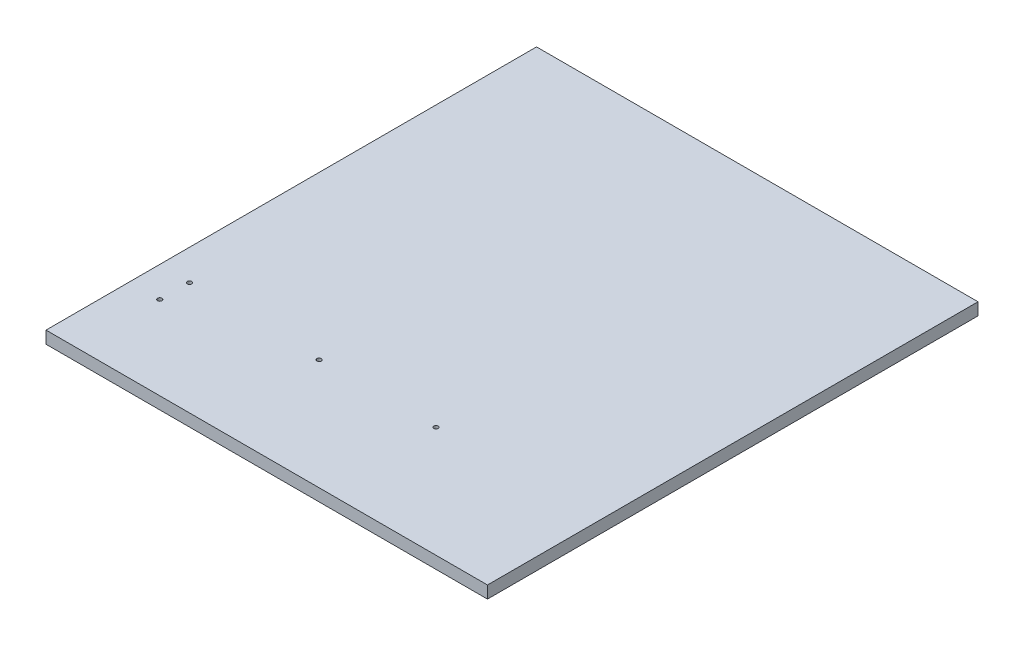
ISO-10303-21;
HEADER;
FILE_DESCRIPTION(('STEP AP214'),'2;1');
FILE_NAME('part.step','',(''),(''),'','','');
FILE_SCHEMA(('AUTOMOTIVE_DESIGN { 1 0 10303 214 1 1 1 1 }'));
ENDSEC;
DATA;
#1=APPLICATION_CONTEXT('core data for automotive mechanical design processes');
#2=APPLICATION_PROTOCOL_DEFINITION('international standard','automotive_design',2000,#1);
#3=PRODUCT_CONTEXT('',#1,'mechanical');
#4=PRODUCT('Part','Part','',(#3));
#5=PRODUCT_RELATED_PRODUCT_CATEGORY('part','',(#4));
#6=PRODUCT_DEFINITION_FORMATION('','',#4);
#7=PRODUCT_DEFINITION_CONTEXT('part definition',#1,'design');
#8=PRODUCT_DEFINITION('design','',#6,#7);
#9=PRODUCT_DEFINITION_SHAPE('','',#8);
#10=(LENGTH_UNIT() NAMED_UNIT(*) SI_UNIT(.MILLI.,.METRE.));
#11=(NAMED_UNIT(*) PLANE_ANGLE_UNIT() SI_UNIT($,.RADIAN.));
#12=(NAMED_UNIT(*) SI_UNIT($,.STERADIAN.) SOLID_ANGLE_UNIT());
#13=UNCERTAINTY_MEASURE_WITH_UNIT(LENGTH_MEASURE(1.E-05),#10,'distance_accuracy_value','');
#14=(GEOMETRIC_REPRESENTATION_CONTEXT(3) GLOBAL_UNCERTAINTY_ASSIGNED_CONTEXT((#13)) GLOBAL_UNIT_ASSIGNED_CONTEXT((#10,
#11,#12)) REPRESENTATION_CONTEXT('',''));
#15=CARTESIAN_POINT('',(0.,0.,0.));
#16=DIRECTION('',(0.,0.,1.));
#17=DIRECTION('',(1.,0.,0.));
#18=AXIS2_PLACEMENT_3D('',#15,#16,#17);
#19=CARTESIAN_POINT('',(0.,6.35,0.));
#20=DIRECTION('',(1.,0.,0.));
#21=DIRECTION('',(0.,0.,-1.));
#22=AXIS2_PLACEMENT_3D('',#19,#20,#21);
#23=PLANE('',#22);
#24=DIRECTION('',(0.,0.,1.));
#25=VECTOR('',#24,1.);
#26=CARTESIAN_POINT('',(0.,0.,0.));
#27=LINE('',#26,#25);
#28=CARTESIAN_POINT('',(0.,0.,-254.));
#29=VERTEX_POINT('',#28);
#30=CARTESIAN_POINT('',(0.,0.,0.));
#31=VERTEX_POINT('',#30);
#32=EDGE_CURVE('E110',#29,#31,#27,.T.);
#33=ORIENTED_EDGE('',*,*,#32,.T.);
#34=DIRECTION('',(0.,-1.,0.));
#35=VECTOR('',#34,1.);
#36=CARTESIAN_POINT('',(0.,6.35,0.));
#37=LINE('',#36,#35);
#38=CARTESIAN_POINT('',(0.,6.35,0.));
#39=VERTEX_POINT('',#38);
#40=EDGE_CURVE('E11',#39,#31,#37,.T.);
#41=ORIENTED_EDGE('',*,*,#40,.F.);
#42=DIRECTION('',(0.,0.,1.));
#43=VECTOR('',#42,1.);
#44=CARTESIAN_POINT('',(0.,6.35,0.));
#45=LINE('',#44,#43);
#46=CARTESIAN_POINT('',(0.,6.35,-254.));
#47=VERTEX_POINT('',#46);
#48=EDGE_CURVE('E98',#47,#39,#45,.T.);
#49=ORIENTED_EDGE('',*,*,#48,.F.);
#50=DIRECTION('',(0.,-1.,0.));
#51=VECTOR('',#50,1.);
#52=CARTESIAN_POINT('',(0.,6.35,-254.));
#53=LINE('',#52,#51);
#54=EDGE_CURVE('E106',#47,#29,#53,.T.);
#55=ORIENTED_EDGE('',*,*,#54,.T.);
#56=EDGE_LOOP('',(#33,#41,#49,#55));
#57=FACE_BOUND('',#56,.T.);
#58=ADVANCED_FACE('F47',(#57),#23,.F.);
#59=CARTESIAN_POINT('',(0.,6.35,0.));
#60=DIRECTION('',(0.,0.,-1.));
#61=DIRECTION('',(-1.,0.,0.));
#62=AXIS2_PLACEMENT_3D('',#59,#60,#61);
#63=PLANE('',#62);
#64=DIRECTION('',(1.,0.,0.));
#65=VECTOR('',#64,1.);
#66=CARTESIAN_POINT('',(0.,0.,0.));
#67=LINE('',#66,#65);
#68=CARTESIAN_POINT('',(228.6,0.,0.));
#69=VERTEX_POINT('',#68);
#70=EDGE_CURVE('E102',#31,#69,#67,.T.);
#71=ORIENTED_EDGE('',*,*,#70,.T.);
#72=DIRECTION('',(0.,-1.,0.));
#73=VECTOR('',#72,1.);
#74=CARTESIAN_POINT('',(228.6,6.35,0.));
#75=LINE('',#74,#73);
#76=CARTESIAN_POINT('',(228.6,6.35,0.));
#77=VERTEX_POINT('',#76);
#78=EDGE_CURVE('E55',#77,#69,#75,.T.);
#79=ORIENTED_EDGE('',*,*,#78,.F.);
#80=DIRECTION('',(1.,0.,0.));
#81=VECTOR('',#80,1.);
#82=CARTESIAN_POINT('',(0.,6.35,0.));
#83=LINE('',#82,#81);
#84=EDGE_CURVE('E93',#39,#77,#83,.T.);
#85=ORIENTED_EDGE('',*,*,#84,.F.);
#86=ORIENTED_EDGE('',*,*,#40,.T.);
#87=EDGE_LOOP('',(#71,#79,#85,#86));
#88=FACE_BOUND('',#87,.T.);
#89=ADVANCED_FACE('F101',(#88),#63,.F.);
#90=CARTESIAN_POINT('',(228.6,6.35,0.));
#91=DIRECTION('',(-1.,0.,0.));
#92=DIRECTION('',(0.,0.,1.));
#93=AXIS2_PLACEMENT_3D('',#90,#91,#92);
#94=PLANE('',#93);
#95=DIRECTION('',(0.,0.,-1.));
#96=VECTOR('',#95,1.);
#97=CARTESIAN_POINT('',(228.6,0.,0.));
#98=LINE('',#97,#96);
#99=CARTESIAN_POINT('',(228.6,0.,-254.));
#100=VERTEX_POINT('',#99);
#101=EDGE_CURVE('E80',#69,#100,#98,.T.);
#102=ORIENTED_EDGE('',*,*,#101,.T.);
#103=DIRECTION('',(0.,-1.,0.));
#104=VECTOR('',#103,1.);
#105=CARTESIAN_POINT('',(228.6,6.35,-254.));
#106=LINE('',#105,#104);
#107=CARTESIAN_POINT('',(228.6,6.35,-254.));
#108=VERTEX_POINT('',#107);
#109=EDGE_CURVE('E103',#108,#100,#106,.T.);
#110=ORIENTED_EDGE('',*,*,#109,.F.);
#111=DIRECTION('',(0.,0.,-1.));
#112=VECTOR('',#111,1.);
#113=CARTESIAN_POINT('',(228.6,6.35,0.));
#114=LINE('',#113,#112);
#115=EDGE_CURVE('E96',#77,#108,#114,.T.);
#116=ORIENTED_EDGE('',*,*,#115,.F.);
#117=ORIENTED_EDGE('',*,*,#78,.T.);
#118=EDGE_LOOP('',(#102,#110,#116,#117));
#119=FACE_BOUND('',#118,.T.);
#120=ADVANCED_FACE('F104',(#119),#94,.F.);
#121=CARTESIAN_POINT('',(0.,6.35,-254.));
#122=DIRECTION('',(0.,0.,1.));
#123=DIRECTION('',(1.,0.,0.));
#124=AXIS2_PLACEMENT_3D('',#121,#122,#123);
#125=PLANE('',#124);
#126=DIRECTION('',(-1.,0.,0.));
#127=VECTOR('',#126,1.);
#128=CARTESIAN_POINT('',(0.,0.,-254.));
#129=LINE('',#128,#127);
#130=EDGE_CURVE('E86',#100,#29,#129,.T.);
#131=ORIENTED_EDGE('',*,*,#130,.T.);
#132=ORIENTED_EDGE('',*,*,#54,.F.);
#133=DIRECTION('',(-1.,0.,0.));
#134=VECTOR('',#133,1.);
#135=CARTESIAN_POINT('',(0.,6.35,-254.));
#136=LINE('',#135,#134);
#137=EDGE_CURVE('E63',#108,#47,#136,.T.);
#138=ORIENTED_EDGE('',*,*,#137,.F.);
#139=ORIENTED_EDGE('',*,*,#109,.T.);
#140=EDGE_LOOP('',(#131,#132,#138,#139));
#141=FACE_BOUND('',#140,.T.);
#142=ADVANCED_FACE('F118',(#141),#125,.F.);
#143=CARTESIAN_POINT('',(0.,6.35,0.));
#144=DIRECTION('',(0.,-1.,0.));
#145=DIRECTION('',(0.,0.,-1.));
#146=AXIS2_PLACEMENT_3D('',#143,#144,#145);
#147=PLANE('',#146);
#148=CARTESIAN_POINT('',(15.7351594072584,6.35,-43.18));
#149=DIRECTION('',(0.,1.,0.));
#150=DIRECTION('',(0.,0.,1.));
#151=AXIS2_PLACEMENT_3D('',#148,#149,#150);
#152=CIRCLE('',#151,1.13029999999999);
#153=CARTESIAN_POINT('',(15.7351594072584,6.35,-42.0497));
#154=VERTEX_POINT('',#153);
#155=EDGE_CURVE('E144',#154,#154,#152,.T.);
#156=ORIENTED_EDGE('',*,*,#155,.F.);
#157=EDGE_LOOP('',(#156));
#158=FACE_BOUND('',#157,.T.);
#159=CARTESIAN_POINT('',(15.8749999999998,6.35,-58.42));
#160=DIRECTION('',(0.,1.,0.));
#161=DIRECTION('',(0.,0.,1.));
#162=AXIS2_PLACEMENT_3D('',#159,#160,#161);
#163=CIRCLE('',#162,1.13029999999999);
#164=CARTESIAN_POINT('',(15.8749999999998,6.35,-57.2897));
#165=VERTEX_POINT('',#164);
#166=EDGE_CURVE('E138',#165,#165,#163,.T.);
#167=ORIENTED_EDGE('',*,*,#166,.F.);
#168=EDGE_LOOP('',(#167));
#169=FACE_BOUND('',#168,.T.);
#170=CARTESIAN_POINT('',(84.0588414103042,6.35,-57.3884371810008));
#171=DIRECTION('',(0.,1.,0.));
#172=DIRECTION('',(0.,0.,1.));
#173=AXIS2_PLACEMENT_3D('',#170,#171,#172);
#174=CIRCLE('',#173,1.13029999999999);
#175=CARTESIAN_POINT('',(84.0588414103042,6.35,-56.2581371810008));
#176=VERTEX_POINT('',#175);
#177=EDGE_CURVE('E132',#176,#176,#174,.T.);
#178=ORIENTED_EDGE('',*,*,#177,.F.);
#179=EDGE_LOOP('',(#178));
#180=FACE_BOUND('',#179,.T.);
#181=CARTESIAN_POINT('',(144.561688198213,6.35,-57.3884371810008));
#182=DIRECTION('',(0.,1.,0.));
#183=DIRECTION('',(0.,0.,1.));
#184=AXIS2_PLACEMENT_3D('',#181,#182,#183);
#185=CIRCLE('',#184,1.1303);
#186=CARTESIAN_POINT('',(144.561688198213,6.35,-56.2581371810008));
#187=VERTEX_POINT('',#186);
#188=EDGE_CURVE('E126',#187,#187,#185,.T.);
#189=ORIENTED_EDGE('',*,*,#188,.F.);
#190=EDGE_LOOP('',(#189));
#191=FACE_BOUND('',#190,.T.);
#192=ORIENTED_EDGE('',*,*,#48,.T.);
#193=ORIENTED_EDGE('',*,*,#84,.T.);
#194=ORIENTED_EDGE('',*,*,#115,.T.);
#195=ORIENTED_EDGE('',*,*,#137,.T.);
#196=EDGE_LOOP('',(#192,#193,#194,#195));
#197=FACE_BOUND('',#196,.T.);
#198=ADVANCED_FACE('F94',(#158,#169,#180,#191,#197),#147,.F.);
#199=CARTESIAN_POINT('',(0.,0.,0.));
#200=DIRECTION('',(0.,-1.,0.));
#201=DIRECTION('',(0.,0.,-1.));
#202=AXIS2_PLACEMENT_3D('',#199,#200,#201);
#203=PLANE('',#202);
#204=CARTESIAN_POINT('',(15.7351594072584,0.,-43.18));
#205=DIRECTION('',(0.,1.,0.));
#206=DIRECTION('',(0.,0.,1.));
#207=AXIS2_PLACEMENT_3D('',#204,#205,#206);
#208=CIRCLE('',#207,1.1303);
#209=CARTESIAN_POINT('',(15.7351594072584,0.,-42.0497));
#210=VERTEX_POINT('',#209);
#211=EDGE_CURVE('E141',#210,#210,#208,.T.);
#212=ORIENTED_EDGE('',*,*,#211,.T.);
#213=EDGE_LOOP('',(#212));
#214=FACE_BOUND('',#213,.T.);
#215=CARTESIAN_POINT('',(15.8749999999998,0.,-58.42));
#216=DIRECTION('',(0.,1.,0.));
#217=DIRECTION('',(0.,0.,1.));
#218=AXIS2_PLACEMENT_3D('',#215,#216,#217);
#219=CIRCLE('',#218,1.1303);
#220=CARTESIAN_POINT('',(15.8749999999998,0.,-57.2897));
#221=VERTEX_POINT('',#220);
#222=EDGE_CURVE('E135',#221,#221,#219,.T.);
#223=ORIENTED_EDGE('',*,*,#222,.T.);
#224=EDGE_LOOP('',(#223));
#225=FACE_BOUND('',#224,.T.);
#226=CARTESIAN_POINT('',(84.0588414103042,0.,-57.3884371810008));
#227=DIRECTION('',(0.,1.,0.));
#228=DIRECTION('',(0.,0.,1.));
#229=AXIS2_PLACEMENT_3D('',#226,#227,#228);
#230=CIRCLE('',#229,1.1303);
#231=CARTESIAN_POINT('',(84.0588414103042,0.,-56.2581371810008));
#232=VERTEX_POINT('',#231);
#233=EDGE_CURVE('E129',#232,#232,#230,.T.);
#234=ORIENTED_EDGE('',*,*,#233,.T.);
#235=EDGE_LOOP('',(#234));
#236=FACE_BOUND('',#235,.T.);
#237=CARTESIAN_POINT('',(144.561688198213,0.,-57.3884371810008));
#238=DIRECTION('',(0.,1.,0.));
#239=DIRECTION('',(0.,0.,1.));
#240=AXIS2_PLACEMENT_3D('',#237,#238,#239);
#241=CIRCLE('',#240,1.1303);
#242=CARTESIAN_POINT('',(144.561688198213,0.,-56.2581371810008));
#243=VERTEX_POINT('',#242);
#244=EDGE_CURVE('E113',#243,#243,#241,.T.);
#245=ORIENTED_EDGE('',*,*,#244,.T.);
#246=EDGE_LOOP('',(#245));
#247=FACE_BOUND('',#246,.T.);
#248=ORIENTED_EDGE('',*,*,#32,.F.);
#249=ORIENTED_EDGE('',*,*,#130,.F.);
#250=ORIENTED_EDGE('',*,*,#101,.F.);
#251=ORIENTED_EDGE('',*,*,#70,.F.);
#252=EDGE_LOOP('',(#248,#249,#250,#251));
#253=FACE_BOUND('',#252,.T.);
#254=ADVANCED_FACE('F121',(#214,#225,#236,#247,#253),#203,.T.);
#255=CARTESIAN_POINT('',(144.561688198213,6.35,-57.3884371810008));
#256=DIRECTION('',(0.,1.,0.));
#257=DIRECTION('',(0.,0.,1.));
#258=AXIS2_PLACEMENT_3D('',#255,#256,#257);
#259=CYLINDRICAL_SURFACE('',#258,1.1303);
#260=ORIENTED_EDGE('',*,*,#244,.F.);
#261=EDGE_LOOP('',(#260));
#262=FACE_BOUND('',#261,.T.);
#263=ORIENTED_EDGE('',*,*,#188,.T.);
#264=EDGE_LOOP('',(#263));
#265=FACE_BOUND('',#264,.T.);
#266=ADVANCED_FACE('F159',(#262,#265),#259,.F.);
#267=CARTESIAN_POINT('',(84.0588414103042,6.35,-57.3884371810008));
#268=DIRECTION('',(0.,1.,0.));
#269=DIRECTION('',(0.,0.,1.));
#270=AXIS2_PLACEMENT_3D('',#267,#268,#269);
#271=CYLINDRICAL_SURFACE('',#270,1.13029999999999);
#272=ORIENTED_EDGE('',*,*,#233,.F.);
#273=EDGE_LOOP('',(#272));
#274=FACE_BOUND('',#273,.T.);
#275=ORIENTED_EDGE('',*,*,#177,.T.);
#276=EDGE_LOOP('',(#275));
#277=FACE_BOUND('',#276,.T.);
#278=ADVANCED_FACE('F161',(#274,#277),#271,.F.);
#279=CARTESIAN_POINT('',(15.8749999999998,6.35,-58.42));
#280=DIRECTION('',(0.,1.,0.));
#281=DIRECTION('',(0.,0.,1.));
#282=AXIS2_PLACEMENT_3D('',#279,#280,#281);
#283=CYLINDRICAL_SURFACE('',#282,1.13029999999999);
#284=ORIENTED_EDGE('',*,*,#222,.F.);
#285=EDGE_LOOP('',(#284));
#286=FACE_BOUND('',#285,.T.);
#287=ORIENTED_EDGE('',*,*,#166,.T.);
#288=EDGE_LOOP('',(#287));
#289=FACE_BOUND('',#288,.T.);
#290=ADVANCED_FACE('F168',(#286,#289),#283,.F.);
#291=CARTESIAN_POINT('',(15.7351594072584,6.35,-43.18));
#292=DIRECTION('',(0.,1.,0.));
#293=DIRECTION('',(0.,0.,1.));
#294=AXIS2_PLACEMENT_3D('',#291,#292,#293);
#295=CYLINDRICAL_SURFACE('',#294,1.13029999999999);
#296=ORIENTED_EDGE('',*,*,#211,.F.);
#297=EDGE_LOOP('',(#296));
#298=FACE_BOUND('',#297,.T.);
#299=ORIENTED_EDGE('',*,*,#155,.T.);
#300=EDGE_LOOP('',(#299));
#301=FACE_BOUND('',#300,.T.);
#302=ADVANCED_FACE('F148',(#298,#301),#295,.F.);
#303=CLOSED_SHELL('',(#58,#89,#120,#142,#198,#254,#266,#278,#290,#302));
#304=MANIFOLD_SOLID_BREP('B2',#303);
#305=ADVANCED_BREP_SHAPE_REPRESENTATION('',(#18,#304),#14);
#306=SHAPE_DEFINITION_REPRESENTATION(#9,#305);
ENDSEC;
END-ISO-10303-21;
